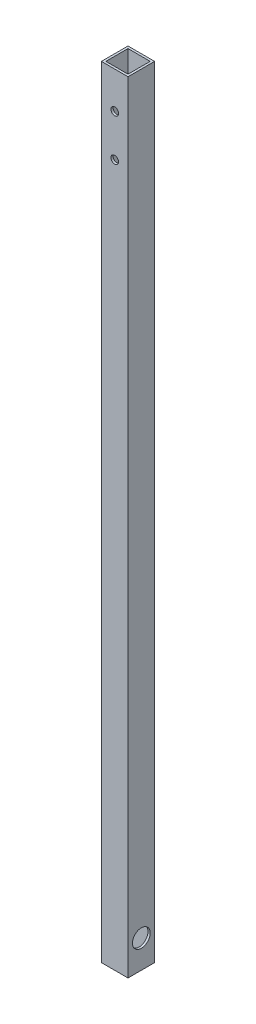
ISO-10303-21;
HEADER;
FILE_DESCRIPTION(('STEP AP214'),'2;1');
FILE_NAME('part.step','',(''),(''),'','','');
FILE_SCHEMA(('AUTOMOTIVE_DESIGN { 1 0 10303 214 1 1 1 1 }'));
ENDSEC;
DATA;
#1=APPLICATION_CONTEXT('core data for automotive mechanical design processes');
#2=APPLICATION_PROTOCOL_DEFINITION('international standard','automotive_design',2000,#1);
#3=PRODUCT_CONTEXT('',#1,'mechanical');
#4=PRODUCT('Part','Part','',(#3));
#5=PRODUCT_RELATED_PRODUCT_CATEGORY('part','',(#4));
#6=PRODUCT_DEFINITION_FORMATION('','',#4);
#7=PRODUCT_DEFINITION_CONTEXT('part definition',#1,'design');
#8=PRODUCT_DEFINITION('design','',#6,#7);
#9=PRODUCT_DEFINITION_SHAPE('','',#8);
#10=(LENGTH_UNIT() NAMED_UNIT(*) SI_UNIT(.MILLI.,.METRE.));
#11=(NAMED_UNIT(*) PLANE_ANGLE_UNIT() SI_UNIT($,.RADIAN.));
#12=(NAMED_UNIT(*) SI_UNIT($,.STERADIAN.) SOLID_ANGLE_UNIT());
#13=UNCERTAINTY_MEASURE_WITH_UNIT(LENGTH_MEASURE(1.E-05),#10,'distance_accuracy_value','');
#14=(GEOMETRIC_REPRESENTATION_CONTEXT(3) GLOBAL_UNCERTAINTY_ASSIGNED_CONTEXT((#13)) GLOBAL_UNIT_ASSIGNED_CONTEXT((#10,
#11,#12)) REPRESENTATION_CONTEXT('',''));
#15=CARTESIAN_POINT('',(0.,0.,0.));
#16=DIRECTION('',(0.,0.,1.));
#17=DIRECTION('',(1.,0.,0.));
#18=AXIS2_PLACEMENT_3D('',#15,#16,#17);
#19=CARTESIAN_POINT('',(0.,914.4,0.));
#20=DIRECTION('',(1.,0.,0.));
#21=DIRECTION('',(0.,0.,-1.));
#22=AXIS2_PLACEMENT_3D('',#19,#20,#21);
#23=PLANE('',#22);
#24=CARTESIAN_POINT('',(0.,20.,-9.525));
#25=DIRECTION('',(1.,0.,0.));
#26=DIRECTION('',(0.,0.,-1.));
#27=AXIS2_PLACEMENT_3D('',#24,#25,#26);
#28=CIRCLE('',#27,6.35);
#29=CARTESIAN_POINT('',(0.,20.,-15.875));
#30=VERTEX_POINT('',#29);
#31=EDGE_CURVE('E151',#30,#30,#28,.T.);
#32=ORIENTED_EDGE('',*,*,#31,.T.);
#33=EDGE_LOOP('',(#32));
#34=FACE_BOUND('',#33,.T.);
#35=DIRECTION('',(0.,0.,1.));
#36=VECTOR('',#35,1.);
#37=CARTESIAN_POINT('',(0.,558.8,-19.05));
#38=LINE('',#37,#36);
#39=CARTESIAN_POINT('',(0.,558.8,-19.05));
#40=VERTEX_POINT('',#39);
#41=CARTESIAN_POINT('',(0.,558.8,0.));
#42=VERTEX_POINT('',#41);
#43=EDGE_CURVE('E112',#40,#42,#38,.T.);
#44=ORIENTED_EDGE('',*,*,#43,.F.);
#45=DIRECTION('',(0.,-1.,0.));
#46=VECTOR('',#45,1.);
#47=CARTESIAN_POINT('',(0.,914.4,-19.05));
#48=LINE('',#47,#46);
#49=CARTESIAN_POINT('',(0.,0.,-19.05));
#50=VERTEX_POINT('',#49);
#51=EDGE_CURVE('E123',#40,#50,#48,.T.);
#52=ORIENTED_EDGE('',*,*,#51,.T.);
#53=DIRECTION('',(0.,0.,1.));
#54=VECTOR('',#53,1.);
#55=CARTESIAN_POINT('',(0.,0.,0.));
#56=LINE('',#55,#54);
#57=CARTESIAN_POINT('',(0.,0.,0.));
#58=VERTEX_POINT('',#57);
#59=EDGE_CURVE('E235',#50,#58,#56,.T.);
#60=ORIENTED_EDGE('',*,*,#59,.T.);
#61=DIRECTION('',(0.,-1.,0.));
#62=VECTOR('',#61,1.);
#63=CARTESIAN_POINT('',(0.,914.4,0.));
#64=LINE('',#63,#62);
#65=EDGE_CURVE('E55',#42,#58,#64,.T.);
#66=ORIENTED_EDGE('',*,*,#65,.F.);
#67=EDGE_LOOP('',(#44,#52,#60,#66));
#68=FACE_BOUND('',#67,.T.);
#69=ADVANCED_FACE('F46',(#34,#68),#23,.F.);
#70=CARTESIAN_POINT('',(0.,914.4,0.));
#71=DIRECTION('',(0.,0.,-1.));
#72=DIRECTION('',(-1.,0.,0.));
#73=AXIS2_PLACEMENT_3D('',#70,#71,#72);
#74=PLANE('',#73);
#75=CARTESIAN_POINT('',(9.53,532.6,0.));
#76=DIRECTION('',(0.,0.,-1.));
#77=DIRECTION('',(-1.,0.,0.));
#78=AXIS2_PLACEMENT_3D('',#75,#76,#77);
#79=CIRCLE('',#78,2.74999999999998);
#80=CARTESIAN_POINT('',(6.78000000000001,532.6,0.));
#81=VERTEX_POINT('',#80);
#82=EDGE_CURVE('E156',#81,#81,#79,.T.);
#83=ORIENTED_EDGE('',*,*,#82,.T.);
#84=EDGE_LOOP('',(#83));
#85=FACE_BOUND('',#84,.T.);
#86=CARTESIAN_POINT('',(9.53,502.6,0.));
#87=DIRECTION('',(0.,0.,-1.));
#88=DIRECTION('',(-1.,0.,0.));
#89=AXIS2_PLACEMENT_3D('',#86,#87,#88);
#90=CIRCLE('',#89,2.74999999999998);
#91=CARTESIAN_POINT('',(6.78000000000001,502.6,0.));
#92=VERTEX_POINT('',#91);
#93=EDGE_CURVE('E176',#92,#92,#90,.T.);
#94=ORIENTED_EDGE('',*,*,#93,.T.);
#95=EDGE_LOOP('',(#94));
#96=FACE_BOUND('',#95,.T.);
#97=DIRECTION('',(-1.,0.,0.));
#98=VECTOR('',#97,1.);
#99=CARTESIAN_POINT('',(0.,558.8,0.));
#100=LINE('',#99,#98);
#101=CARTESIAN_POINT('',(19.05,558.8,0.));
#102=VERTEX_POINT('',#101);
#103=EDGE_CURVE('E118',#102,#42,#100,.T.);
#104=ORIENTED_EDGE('',*,*,#103,.T.);
#105=ORIENTED_EDGE('',*,*,#65,.T.);
#106=DIRECTION('',(1.,0.,0.));
#107=VECTOR('',#106,1.);
#108=CARTESIAN_POINT('',(0.,0.,0.));
#109=LINE('',#108,#107);
#110=CARTESIAN_POINT('',(19.05,0.,0.));
#111=VERTEX_POINT('',#110);
#112=EDGE_CURVE('E238',#58,#111,#109,.T.);
#113=ORIENTED_EDGE('',*,*,#112,.T.);
#114=DIRECTION('',(0.,-1.,0.));
#115=VECTOR('',#114,1.);
#116=CARTESIAN_POINT('',(19.05,914.4,0.));
#117=LINE('',#116,#115);
#118=EDGE_CURVE('E137',#102,#111,#117,.T.);
#119=ORIENTED_EDGE('',*,*,#118,.F.);
#120=EDGE_LOOP('',(#104,#105,#113,#119));
#121=FACE_BOUND('',#120,.T.);
#122=ADVANCED_FACE('F252',(#85,#96,#121),#74,.F.);
#123=CARTESIAN_POINT('',(19.05,914.4,0.));
#124=DIRECTION('',(-1.,0.,0.));
#125=DIRECTION('',(0.,0.,1.));
#126=AXIS2_PLACEMENT_3D('',#123,#124,#125);
#127=PLANE('',#126);
#128=CARTESIAN_POINT('',(19.05,20.,-9.525));
#129=DIRECTION('',(1.,0.,0.));
#130=DIRECTION('',(0.,0.,-1.));
#131=AXIS2_PLACEMENT_3D('',#128,#129,#130);
#132=CIRCLE('',#131,6.35);
#133=CARTESIAN_POINT('',(19.05,20.,-15.875));
#134=VERTEX_POINT('',#133);
#135=EDGE_CURVE('E197',#134,#134,#132,.T.);
#136=ORIENTED_EDGE('',*,*,#135,.F.);
#137=EDGE_LOOP('',(#136));
#138=FACE_BOUND('',#137,.T.);
#139=DIRECTION('',(0.,0.,1.));
#140=VECTOR('',#139,1.);
#141=CARTESIAN_POINT('',(19.05,558.8,-19.05));
#142=LINE('',#141,#140);
#143=CARTESIAN_POINT('',(19.05,558.8,-19.05));
#144=VERTEX_POINT('',#143);
#145=EDGE_CURVE('E63',#144,#102,#142,.T.);
#146=ORIENTED_EDGE('',*,*,#145,.T.);
#147=ORIENTED_EDGE('',*,*,#118,.T.);
#148=DIRECTION('',(0.,0.,-1.));
#149=VECTOR('',#148,1.);
#150=CARTESIAN_POINT('',(19.05,0.,0.));
#151=LINE('',#150,#149);
#152=CARTESIAN_POINT('',(19.05,0.,-19.05));
#153=VERTEX_POINT('',#152);
#154=EDGE_CURVE('E139',#111,#153,#151,.T.);
#155=ORIENTED_EDGE('',*,*,#154,.T.);
#156=DIRECTION('',(0.,-1.,0.));
#157=VECTOR('',#156,1.);
#158=CARTESIAN_POINT('',(19.05,914.4,-19.05));
#159=LINE('',#158,#157);
#160=EDGE_CURVE('E133',#144,#153,#159,.T.);
#161=ORIENTED_EDGE('',*,*,#160,.F.);
#162=EDGE_LOOP('',(#146,#147,#155,#161));
#163=FACE_BOUND('',#162,.T.);
#164=ADVANCED_FACE('F245',(#138,#163),#127,.F.);
#165=CARTESIAN_POINT('',(0.,914.4,-19.05));
#166=DIRECTION('',(0.,0.,1.));
#167=DIRECTION('',(1.,0.,0.));
#168=AXIS2_PLACEMENT_3D('',#165,#166,#167);
#169=PLANE('',#168);
#170=CARTESIAN_POINT('',(9.53,532.6,-19.05));
#171=DIRECTION('',(0.,0.,-1.));
#172=DIRECTION('',(-1.,0.,0.));
#173=AXIS2_PLACEMENT_3D('',#170,#171,#172);
#174=CIRCLE('',#173,2.74999999999998);
#175=CARTESIAN_POINT('',(6.78000000000001,532.6,-19.05));
#176=VERTEX_POINT('',#175);
#177=EDGE_CURVE('E164',#176,#176,#174,.T.);
#178=ORIENTED_EDGE('',*,*,#177,.F.);
#179=EDGE_LOOP('',(#178));
#180=FACE_BOUND('',#179,.T.);
#181=CARTESIAN_POINT('',(9.53,502.6,-19.05));
#182=DIRECTION('',(0.,0.,-1.));
#183=DIRECTION('',(-1.,0.,0.));
#184=AXIS2_PLACEMENT_3D('',#181,#182,#183);
#185=CIRCLE('',#184,2.74999999999998);
#186=CARTESIAN_POINT('',(6.78000000000001,502.6,-19.05));
#187=VERTEX_POINT('',#186);
#188=EDGE_CURVE('E170',#187,#187,#185,.T.);
#189=ORIENTED_EDGE('',*,*,#188,.F.);
#190=EDGE_LOOP('',(#189));
#191=FACE_BOUND('',#190,.T.);
#192=DIRECTION('',(-1.,0.,0.));
#193=VECTOR('',#192,1.);
#194=CARTESIAN_POINT('',(0.,558.8,-19.05));
#195=LINE('',#194,#193);
#196=EDGE_CURVE('E109',#144,#40,#195,.T.);
#197=ORIENTED_EDGE('',*,*,#196,.F.);
#198=ORIENTED_EDGE('',*,*,#160,.T.);
#199=DIRECTION('',(-1.,0.,0.));
#200=VECTOR('',#199,1.);
#201=CARTESIAN_POINT('',(0.,0.,-19.05));
#202=LINE('',#201,#200);
#203=EDGE_CURVE('E130',#153,#50,#202,.T.);
#204=ORIENTED_EDGE('',*,*,#203,.T.);
#205=ORIENTED_EDGE('',*,*,#51,.F.);
#206=EDGE_LOOP('',(#197,#198,#204,#205));
#207=FACE_BOUND('',#206,.T.);
#208=ADVANCED_FACE('F128',(#180,#191,#207),#169,.F.);
#209=CARTESIAN_POINT('',(1.5875,914.4,-1.5875));
#210=DIRECTION('',(1.,0.,0.));
#211=DIRECTION('',(0.,0.,-1.));
#212=AXIS2_PLACEMENT_3D('',#209,#210,#211);
#213=PLANE('',#212);
#214=CARTESIAN_POINT('',(1.5875,20.,-9.525));
#215=DIRECTION('',(1.,0.,0.));
#216=DIRECTION('',(0.,0.,-1.));
#217=AXIS2_PLACEMENT_3D('',#214,#215,#216);
#218=CIRCLE('',#217,6.35);
#219=CARTESIAN_POINT('',(1.5875,20.,-15.875));
#220=VERTEX_POINT('',#219);
#221=EDGE_CURVE('E150',#220,#220,#218,.T.);
#222=ORIENTED_EDGE('',*,*,#221,.F.);
#223=EDGE_LOOP('',(#222));
#224=FACE_BOUND('',#223,.T.);
#225=DIRECTION('',(0.,-1.,0.));
#226=VECTOR('',#225,1.);
#227=CARTESIAN_POINT('',(1.5875,914.4,-17.4625));
#228=LINE('',#227,#226);
#229=CARTESIAN_POINT('',(1.5875,558.8,-17.4625));
#230=VERTEX_POINT('',#229);
#231=CARTESIAN_POINT('',(1.5875,0.,-17.4625));
#232=VERTEX_POINT('',#231);
#233=EDGE_CURVE('E223',#230,#232,#228,.T.);
#234=ORIENTED_EDGE('',*,*,#233,.F.);
#235=DIRECTION('',(0.,0.,1.));
#236=VECTOR('',#235,1.);
#237=CARTESIAN_POINT('',(1.5875,558.8,-1.5875));
#238=LINE('',#237,#236);
#239=CARTESIAN_POINT('',(1.5875,558.8,-1.5875));
#240=VERTEX_POINT('',#239);
#241=EDGE_CURVE('E71',#230,#240,#238,.T.);
#242=ORIENTED_EDGE('',*,*,#241,.T.);
#243=DIRECTION('',(0.,-1.,0.));
#244=VECTOR('',#243,1.);
#245=CARTESIAN_POINT('',(1.5875,914.4,-1.5875));
#246=LINE('',#245,#244);
#247=CARTESIAN_POINT('',(1.5875,0.,-1.5875));
#248=VERTEX_POINT('',#247);
#249=EDGE_CURVE('E232',#240,#248,#246,.T.);
#250=ORIENTED_EDGE('',*,*,#249,.T.);
#251=DIRECTION('',(0.,0.,1.));
#252=VECTOR('',#251,1.);
#253=CARTESIAN_POINT('',(1.5875,0.,-1.5875));
#254=LINE('',#253,#252);
#255=EDGE_CURVE('E207',#232,#248,#254,.T.);
#256=ORIENTED_EDGE('',*,*,#255,.F.);
#257=EDGE_LOOP('',(#234,#242,#250,#256));
#258=FACE_BOUND('',#257,.T.);
#259=ADVANCED_FACE('F265',(#224,#258),#213,.T.);
#260=CARTESIAN_POINT('',(1.5875,914.4,-1.5875));
#261=DIRECTION('',(0.,0.,-1.));
#262=DIRECTION('',(-1.,0.,0.));
#263=AXIS2_PLACEMENT_3D('',#260,#261,#262);
#264=PLANE('',#263);
#265=CARTESIAN_POINT('',(9.53,532.6,-1.5875));
#266=DIRECTION('',(0.,0.,-1.));
#267=DIRECTION('',(-1.,0.,0.));
#268=AXIS2_PLACEMENT_3D('',#265,#266,#267);
#269=CIRCLE('',#268,2.74999999999998);
#270=CARTESIAN_POINT('',(6.78000000000001,532.6,-1.5875));
#271=VERTEX_POINT('',#270);
#272=EDGE_CURVE('E180',#271,#271,#269,.T.);
#273=ORIENTED_EDGE('',*,*,#272,.F.);
#274=EDGE_LOOP('',(#273));
#275=FACE_BOUND('',#274,.T.);
#276=CARTESIAN_POINT('',(9.53,502.6,-1.5875));
#277=DIRECTION('',(0.,0.,-1.));
#278=DIRECTION('',(-1.,0.,0.));
#279=AXIS2_PLACEMENT_3D('',#276,#277,#278);
#280=CIRCLE('',#279,2.74999999999998);
#281=CARTESIAN_POINT('',(6.78000000000001,502.6,-1.5875));
#282=VERTEX_POINT('',#281);
#283=EDGE_CURVE('E155',#282,#282,#280,.T.);
#284=ORIENTED_EDGE('',*,*,#283,.F.);
#285=EDGE_LOOP('',(#284));
#286=FACE_BOUND('',#285,.T.);
#287=ORIENTED_EDGE('',*,*,#249,.F.);
#288=DIRECTION('',(1.,0.,0.));
#289=VECTOR('',#288,1.);
#290=CARTESIAN_POINT('',(1.5875,558.8,-1.5875));
#291=LINE('',#290,#289);
#292=CARTESIAN_POINT('',(17.4625,558.8,-1.5875));
#293=VERTEX_POINT('',#292);
#294=EDGE_CURVE('E191',#240,#293,#291,.T.);
#295=ORIENTED_EDGE('',*,*,#294,.T.);
#296=DIRECTION('',(0.,-1.,0.));
#297=VECTOR('',#296,1.);
#298=CARTESIAN_POINT('',(17.4625,914.4,-1.5875));
#299=LINE('',#298,#297);
#300=CARTESIAN_POINT('',(17.4625,0.,-1.5875));
#301=VERTEX_POINT('',#300);
#302=EDGE_CURVE('E229',#293,#301,#299,.T.);
#303=ORIENTED_EDGE('',*,*,#302,.T.);
#304=DIRECTION('',(1.,0.,0.));
#305=VECTOR('',#304,1.);
#306=CARTESIAN_POINT('',(1.5875,0.,-1.5875));
#307=LINE('',#306,#305);
#308=EDGE_CURVE('E211',#248,#301,#307,.T.);
#309=ORIENTED_EDGE('',*,*,#308,.F.);
#310=EDGE_LOOP('',(#287,#295,#303,#309));
#311=FACE_BOUND('',#310,.T.);
#312=ADVANCED_FACE('F273',(#275,#286,#311),#264,.T.);
#313=CARTESIAN_POINT('',(17.4625,914.4,-1.5875));
#314=DIRECTION('',(-1.,0.,0.));
#315=DIRECTION('',(0.,0.,1.));
#316=AXIS2_PLACEMENT_3D('',#313,#314,#315);
#317=PLANE('',#316);
#318=CARTESIAN_POINT('',(17.4625,20.,-9.525));
#319=DIRECTION('',(-1.,0.,0.));
#320=DIRECTION('',(0.,0.,1.));
#321=AXIS2_PLACEMENT_3D('',#318,#319,#320);
#322=CIRCLE('',#321,6.35);
#323=CARTESIAN_POINT('',(17.4625,20.,-3.175));
#324=VERTEX_POINT('',#323);
#325=EDGE_CURVE('E147',#324,#324,#322,.T.);
#326=ORIENTED_EDGE('',*,*,#325,.F.);
#327=EDGE_LOOP('',(#326));
#328=FACE_BOUND('',#327,.T.);
#329=ORIENTED_EDGE('',*,*,#302,.F.);
#330=DIRECTION('',(0.,0.,-1.));
#331=VECTOR('',#330,1.);
#332=CARTESIAN_POINT('',(17.4625,558.8,-1.5875));
#333=LINE('',#332,#331);
#334=CARTESIAN_POINT('',(17.4625,558.8,-17.4625));
#335=VERTEX_POINT('',#334);
#336=EDGE_CURVE('E126',#293,#335,#333,.T.);
#337=ORIENTED_EDGE('',*,*,#336,.T.);
#338=DIRECTION('',(0.,-1.,0.));
#339=VECTOR('',#338,1.);
#340=CARTESIAN_POINT('',(17.4625,914.4,-17.4625));
#341=LINE('',#340,#339);
#342=CARTESIAN_POINT('',(17.4625,0.,-17.4625));
#343=VERTEX_POINT('',#342);
#344=EDGE_CURVE('E226',#335,#343,#341,.T.);
#345=ORIENTED_EDGE('',*,*,#344,.T.);
#346=DIRECTION('',(0.,0.,-1.));
#347=VECTOR('',#346,1.);
#348=CARTESIAN_POINT('',(17.4625,0.,-1.5875));
#349=LINE('',#348,#347);
#350=EDGE_CURVE('E215',#301,#343,#349,.T.);
#351=ORIENTED_EDGE('',*,*,#350,.F.);
#352=EDGE_LOOP('',(#329,#337,#345,#351));
#353=FACE_BOUND('',#352,.T.);
#354=ADVANCED_FACE('F277',(#328,#353),#317,.T.);
#355=CARTESIAN_POINT('',(1.5875,914.4,-17.4625));
#356=DIRECTION('',(0.,0.,1.));
#357=DIRECTION('',(1.,0.,0.));
#358=AXIS2_PLACEMENT_3D('',#355,#356,#357);
#359=PLANE('',#358);
#360=CARTESIAN_POINT('',(9.53,532.6,-17.4625));
#361=DIRECTION('',(0.,0.,1.));
#362=DIRECTION('',(1.,0.,0.));
#363=AXIS2_PLACEMENT_3D('',#360,#361,#362);
#364=CIRCLE('',#363,2.74999999999998);
#365=CARTESIAN_POINT('',(12.28,532.6,-17.4625));
#366=VERTEX_POINT('',#365);
#367=EDGE_CURVE('E49',#366,#366,#364,.T.);
#368=ORIENTED_EDGE('',*,*,#367,.F.);
#369=EDGE_LOOP('',(#368));
#370=FACE_BOUND('',#369,.T.);
#371=CARTESIAN_POINT('',(9.53,502.6,-17.4625));
#372=DIRECTION('',(0.,0.,1.));
#373=DIRECTION('',(1.,0.,0.));
#374=AXIS2_PLACEMENT_3D('',#371,#372,#373);
#375=CIRCLE('',#374,2.74999999999998);
#376=CARTESIAN_POINT('',(12.28,502.6,-17.4625));
#377=VERTEX_POINT('',#376);
#378=EDGE_CURVE('E152',#377,#377,#375,.T.);
#379=ORIENTED_EDGE('',*,*,#378,.F.);
#380=EDGE_LOOP('',(#379));
#381=FACE_BOUND('',#380,.T.);
#382=ORIENTED_EDGE('',*,*,#344,.F.);
#383=DIRECTION('',(-1.,0.,0.));
#384=VECTOR('',#383,1.);
#385=CARTESIAN_POINT('',(1.5875,558.8,-17.4625));
#386=LINE('',#385,#384);
#387=EDGE_CURVE('E12',#335,#230,#386,.T.);
#388=ORIENTED_EDGE('',*,*,#387,.T.);
#389=ORIENTED_EDGE('',*,*,#233,.T.);
#390=DIRECTION('',(-1.,0.,0.));
#391=VECTOR('',#390,1.);
#392=CARTESIAN_POINT('',(1.5875,0.,-17.4625));
#393=LINE('',#392,#391);
#394=EDGE_CURVE('E219',#343,#232,#393,.T.);
#395=ORIENTED_EDGE('',*,*,#394,.F.);
#396=EDGE_LOOP('',(#382,#388,#389,#395));
#397=FACE_BOUND('',#396,.T.);
#398=ADVANCED_FACE('F270',(#370,#381,#397),#359,.T.);
#399=CARTESIAN_POINT('',(0.,0.,0.));
#400=DIRECTION('',(0.,-1.,0.));
#401=DIRECTION('',(0.,0.,-1.));
#402=AXIS2_PLACEMENT_3D('',#399,#400,#401);
#403=PLANE('',#402);
#404=ORIENTED_EDGE('',*,*,#59,.F.);
#405=ORIENTED_EDGE('',*,*,#203,.F.);
#406=ORIENTED_EDGE('',*,*,#154,.F.);
#407=ORIENTED_EDGE('',*,*,#112,.F.);
#408=EDGE_LOOP('',(#404,#405,#406,#407));
#409=FACE_BOUND('',#408,.T.);
#410=ORIENTED_EDGE('',*,*,#394,.T.);
#411=ORIENTED_EDGE('',*,*,#255,.T.);
#412=ORIENTED_EDGE('',*,*,#308,.T.);
#413=ORIENTED_EDGE('',*,*,#350,.T.);
#414=EDGE_LOOP('',(#410,#411,#412,#413));
#415=FACE_BOUND('',#414,.T.);
#416=ADVANCED_FACE('F249',(#409,#415),#403,.T.);
#417=CARTESIAN_POINT('',(0.,20.,-9.525));
#418=DIRECTION('',(1.,0.,0.));
#419=DIRECTION('',(0.,0.,-1.));
#420=AXIS2_PLACEMENT_3D('',#417,#418,#419);
#421=CYLINDRICAL_SURFACE('',#420,6.35);
#422=ORIENTED_EDGE('',*,*,#325,.T.);
#423=EDGE_LOOP('',(#422));
#424=FACE_BOUND('',#423,.T.);
#425=ORIENTED_EDGE('',*,*,#135,.T.);
#426=EDGE_LOOP('',(#425));
#427=FACE_BOUND('',#426,.T.);
#428=ADVANCED_FACE('F269',(#424,#427),#421,.F.);
#429=ORIENTED_EDGE('',*,*,#221,.T.);
#430=EDGE_LOOP('',(#429));
#431=FACE_BOUND('',#430,.T.);
#432=ORIENTED_EDGE('',*,*,#31,.F.);
#433=EDGE_LOOP('',(#432));
#434=FACE_BOUND('',#433,.T.);
#435=ADVANCED_FACE('F287',(#431,#434),#421,.F.);
#436=CARTESIAN_POINT('',(0.,558.8,-19.05));
#437=DIRECTION('',(0.,1.,0.));
#438=DIRECTION('',(0.,0.,1.));
#439=AXIS2_PLACEMENT_3D('',#436,#437,#438);
#440=PLANE('',#439);
#441=ORIENTED_EDGE('',*,*,#387,.F.);
#442=ORIENTED_EDGE('',*,*,#336,.F.);
#443=ORIENTED_EDGE('',*,*,#294,.F.);
#444=ORIENTED_EDGE('',*,*,#241,.F.);
#445=EDGE_LOOP('',(#441,#442,#443,#444));
#446=FACE_BOUND('',#445,.T.);
#447=ORIENTED_EDGE('',*,*,#103,.F.);
#448=ORIENTED_EDGE('',*,*,#145,.F.);
#449=ORIENTED_EDGE('',*,*,#196,.T.);
#450=ORIENTED_EDGE('',*,*,#43,.T.);
#451=EDGE_LOOP('',(#447,#448,#449,#450));
#452=FACE_BOUND('',#451,.T.);
#453=ADVANCED_FACE('F111',(#446,#452),#440,.T.);
#454=CARTESIAN_POINT('',(9.53,502.6,0.));
#455=DIRECTION('',(0.,0.,-1.));
#456=DIRECTION('',(-1.,0.,0.));
#457=AXIS2_PLACEMENT_3D('',#454,#455,#456);
#458=CYLINDRICAL_SURFACE('',#457,2.74999999999998);
#459=ORIENTED_EDGE('',*,*,#378,.T.);
#460=EDGE_LOOP('',(#459));
#461=FACE_BOUND('',#460,.T.);
#462=ORIENTED_EDGE('',*,*,#188,.T.);
#463=EDGE_LOOP('',(#462));
#464=FACE_BOUND('',#463,.T.);
#465=ADVANCED_FACE('F291',(#461,#464),#458,.F.);
#466=CARTESIAN_POINT('',(9.53,532.6,0.));
#467=DIRECTION('',(0.,0.,-1.));
#468=DIRECTION('',(-1.,0.,0.));
#469=AXIS2_PLACEMENT_3D('',#466,#467,#468);
#470=CYLINDRICAL_SURFACE('',#469,2.74999999999998);
#471=ORIENTED_EDGE('',*,*,#367,.T.);
#472=EDGE_LOOP('',(#471));
#473=FACE_BOUND('',#472,.T.);
#474=ORIENTED_EDGE('',*,*,#177,.T.);
#475=EDGE_LOOP('',(#474));
#476=FACE_BOUND('',#475,.T.);
#477=ADVANCED_FACE('F294',(#473,#476),#470,.F.);
#478=ORIENTED_EDGE('',*,*,#283,.T.);
#479=EDGE_LOOP('',(#478));
#480=FACE_BOUND('',#479,.T.);
#481=ORIENTED_EDGE('',*,*,#93,.F.);
#482=EDGE_LOOP('',(#481));
#483=FACE_BOUND('',#482,.T.);
#484=ADVANCED_FACE('F295',(#480,#483),#458,.F.);
#485=ORIENTED_EDGE('',*,*,#272,.T.);
#486=EDGE_LOOP('',(#485));
#487=FACE_BOUND('',#486,.T.);
#488=ORIENTED_EDGE('',*,*,#82,.F.);
#489=EDGE_LOOP('',(#488));
#490=FACE_BOUND('',#489,.T.);
#491=ADVANCED_FACE('F298',(#487,#490),#470,.F.);
#492=CLOSED_SHELL('',(#69,#122,#164,#208,#259,#312,#354,#398,#416,#428,#435,#453,#465,#477,#484,#491));
#493=MANIFOLD_SOLID_BREP('B2',#492);
#494=ADVANCED_BREP_SHAPE_REPRESENTATION('',(#18,#493),#14);
#495=SHAPE_DEFINITION_REPRESENTATION(#9,#494);
ENDSEC;
END-ISO-10303-21;
